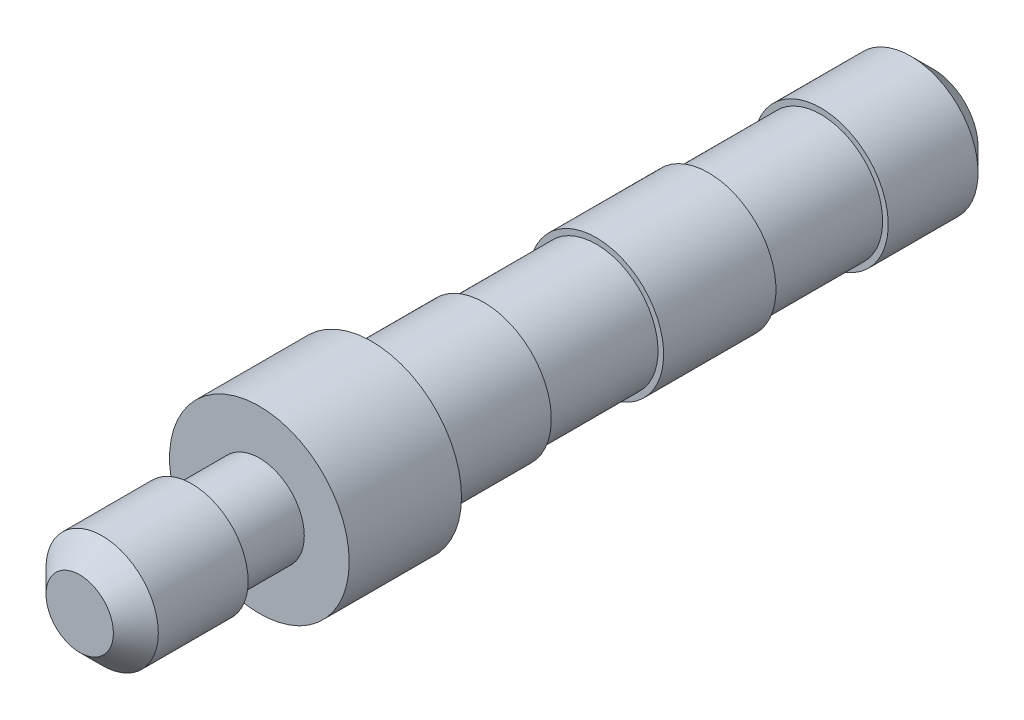
ISO-10303-21;
HEADER;
FILE_DESCRIPTION(('STEP AP214'),'2;1');
FILE_NAME('part.step','',(''),(''),'','','');
FILE_SCHEMA(('AUTOMOTIVE_DESIGN { 1 0 10303 214 1 1 1 1 }'));
ENDSEC;
DATA;
#1=APPLICATION_CONTEXT('core data for automotive mechanical design processes');
#2=APPLICATION_PROTOCOL_DEFINITION('international standard','automotive_design',2000,#1);
#3=PRODUCT_CONTEXT('',#1,'mechanical');
#4=PRODUCT('Part','Part','',(#3));
#5=PRODUCT_RELATED_PRODUCT_CATEGORY('part','',(#4));
#6=PRODUCT_DEFINITION_FORMATION('','',#4);
#7=PRODUCT_DEFINITION_CONTEXT('part definition',#1,'design');
#8=PRODUCT_DEFINITION('design','',#6,#7);
#9=PRODUCT_DEFINITION_SHAPE('','',#8);
#10=(LENGTH_UNIT() NAMED_UNIT(*) SI_UNIT(.MILLI.,.METRE.));
#11=(NAMED_UNIT(*) PLANE_ANGLE_UNIT() SI_UNIT($,.RADIAN.));
#12=(NAMED_UNIT(*) SI_UNIT($,.STERADIAN.) SOLID_ANGLE_UNIT());
#13=UNCERTAINTY_MEASURE_WITH_UNIT(LENGTH_MEASURE(1.E-05),#10,'distance_accuracy_value','');
#14=(GEOMETRIC_REPRESENTATION_CONTEXT(3) GLOBAL_UNCERTAINTY_ASSIGNED_CONTEXT((#13)) GLOBAL_UNIT_ASSIGNED_CONTEXT((#10,
#11,#12)) REPRESENTATION_CONTEXT('',''));
#15=CARTESIAN_POINT('',(0.,0.,0.));
#16=DIRECTION('',(0.,0.,1.));
#17=DIRECTION('',(1.,0.,0.));
#18=AXIS2_PLACEMENT_3D('',#15,#16,#17);
#19=CARTESIAN_POINT('',(0.,0.,5.));
#20=DIRECTION('',(0.,0.,-1.));
#21=DIRECTION('',(-1.,0.,0.));
#22=AXIS2_PLACEMENT_3D('',#19,#20,#21);
#23=CYLINDRICAL_SURFACE('',#22,4.);
#24=CARTESIAN_POINT('',(0.,0.,5.));
#25=DIRECTION('',(0.,0.,1.));
#26=DIRECTION('',(1.,0.,0.));
#27=AXIS2_PLACEMENT_3D('',#24,#25,#26);
#28=CIRCLE('',#27,4.);
#29=CARTESIAN_POINT('',(4.,0.,5.));
#30=VERTEX_POINT('',#29);
#31=EDGE_CURVE('E65',#30,#30,#28,.T.);
#32=ORIENTED_EDGE('',*,*,#31,.F.);
#33=EDGE_LOOP('',(#32));
#34=FACE_BOUND('',#33,.T.);
#35=CARTESIAN_POINT('',(0.,0.,0.));
#36=DIRECTION('',(0.,0.,1.));
#37=DIRECTION('',(1.,0.,0.));
#38=AXIS2_PLACEMENT_3D('',#35,#36,#37);
#39=CIRCLE('',#38,4.);
#40=CARTESIAN_POINT('',(4.,0.,0.));
#41=VERTEX_POINT('',#40);
#42=EDGE_CURVE('E62',#41,#41,#39,.T.);
#43=ORIENTED_EDGE('',*,*,#42,.T.);
#44=EDGE_LOOP('',(#43));
#45=FACE_BOUND('',#44,.T.);
#46=ADVANCED_FACE('F37',(#34,#45),#23,.T.);
#47=CARTESIAN_POINT('',(0.,0.,5.));
#48=DIRECTION('',(0.,0.,1.));
#49=DIRECTION('',(1.,0.,0.));
#50=AXIS2_PLACEMENT_3D('',#47,#48,#49);
#51=PLANE('',#50);
#52=CARTESIAN_POINT('',(0.,0.,5.));
#53=DIRECTION('',(0.,0.,1.));
#54=DIRECTION('',(1.,0.,0.));
#55=AXIS2_PLACEMENT_3D('',#52,#53,#54);
#56=CIRCLE('',#55,2.);
#57=CARTESIAN_POINT('',(2.,0.,5.));
#58=VERTEX_POINT('',#57);
#59=EDGE_CURVE('E49',#58,#58,#56,.T.);
#60=ORIENTED_EDGE('',*,*,#59,.F.);
#61=EDGE_LOOP('',(#60));
#62=FACE_BOUND('',#61,.T.);
#63=ORIENTED_EDGE('',*,*,#31,.T.);
#64=EDGE_LOOP('',(#63));
#65=FACE_BOUND('',#64,.T.);
#66=ADVANCED_FACE('F116',(#62,#65),#51,.T.);
#67=CARTESIAN_POINT('',(0.,0.,0.));
#68=DIRECTION('',(0.,0.,1.));
#69=DIRECTION('',(1.,0.,0.));
#70=AXIS2_PLACEMENT_3D('',#67,#68,#69);
#71=PLANE('',#70);
#72=CARTESIAN_POINT('',(0.,0.,0.));
#73=DIRECTION('',(0.,0.,-1.));
#74=DIRECTION('',(-1.,0.,0.));
#75=AXIS2_PLACEMENT_3D('',#72,#73,#74);
#76=CIRCLE('',#75,3.);
#77=CARTESIAN_POINT('',(-3.,0.,0.));
#78=VERTEX_POINT('',#77);
#79=EDGE_CURVE('E69',#78,#78,#76,.T.);
#80=ORIENTED_EDGE('',*,*,#79,.F.);
#81=EDGE_LOOP('',(#80));
#82=FACE_BOUND('',#81,.T.);
#83=ORIENTED_EDGE('',*,*,#42,.F.);
#84=EDGE_LOOP('',(#83));
#85=FACE_BOUND('',#84,.T.);
#86=ADVANCED_FACE('F122',(#82,#85),#71,.F.);
#87=CARTESIAN_POINT('',(0.,0.,-5.));
#88=DIRECTION('',(0.,0.,1.));
#89=DIRECTION('',(1.,0.,0.));
#90=AXIS2_PLACEMENT_3D('',#87,#88,#89);
#91=CYLINDRICAL_SURFACE('',#90,3.);
#92=CARTESIAN_POINT('',(0.,0.,-5.));
#93=DIRECTION('',(0.,0.,-1.));
#94=DIRECTION('',(-1.,0.,0.));
#95=AXIS2_PLACEMENT_3D('',#92,#93,#94);
#96=CIRCLE('',#95,3.);
#97=CARTESIAN_POINT('',(-3.,0.,-5.));
#98=VERTEX_POINT('',#97);
#99=EDGE_CURVE('E66',#98,#98,#96,.T.);
#100=ORIENTED_EDGE('',*,*,#99,.F.);
#101=EDGE_LOOP('',(#100));
#102=FACE_BOUND('',#101,.T.);
#103=ORIENTED_EDGE('',*,*,#79,.T.);
#104=EDGE_LOOP('',(#103));
#105=FACE_BOUND('',#104,.T.);
#106=ADVANCED_FACE('F181',(#102,#105),#91,.T.);
#107=CARTESIAN_POINT('',(0.,0.,-5.));
#108=DIRECTION('',(0.,0.,-1.));
#109=DIRECTION('',(-1.,0.,0.));
#110=AXIS2_PLACEMENT_3D('',#107,#108,#109);
#111=PLANE('',#110);
#112=CARTESIAN_POINT('',(0.,0.,-5.));
#113=DIRECTION('',(0.,0.,-1.));
#114=DIRECTION('',(-1.,0.,0.));
#115=AXIS2_PLACEMENT_3D('',#112,#113,#114);
#116=CIRCLE('',#115,2.75);
#117=CARTESIAN_POINT('',(-2.75,0.,-5.));
#118=VERTEX_POINT('',#117);
#119=EDGE_CURVE('E72',#118,#118,#116,.T.);
#120=ORIENTED_EDGE('',*,*,#119,.F.);
#121=EDGE_LOOP('',(#120));
#122=FACE_BOUND('',#121,.T.);
#123=ORIENTED_EDGE('',*,*,#99,.T.);
#124=EDGE_LOOP('',(#123));
#125=FACE_BOUND('',#124,.T.);
#126=ADVANCED_FACE('F177',(#122,#125),#111,.T.);
#127=CARTESIAN_POINT('',(0.,0.,-10.));
#128=DIRECTION('',(0.,0.,1.));
#129=DIRECTION('',(1.,0.,0.));
#130=AXIS2_PLACEMENT_3D('',#127,#128,#129);
#131=CYLINDRICAL_SURFACE('',#130,2.75);
#132=CARTESIAN_POINT('',(0.,0.,-10.));
#133=DIRECTION('',(0.,0.,-1.));
#134=DIRECTION('',(-1.,0.,0.));
#135=AXIS2_PLACEMENT_3D('',#132,#133,#134);
#136=CIRCLE('',#135,2.75);
#137=CARTESIAN_POINT('',(-2.75,0.,-10.));
#138=VERTEX_POINT('',#137);
#139=EDGE_CURVE('E75',#138,#138,#136,.T.);
#140=ORIENTED_EDGE('',*,*,#139,.F.);
#141=EDGE_LOOP('',(#140));
#142=FACE_BOUND('',#141,.T.);
#143=ORIENTED_EDGE('',*,*,#119,.T.);
#144=EDGE_LOOP('',(#143));
#145=FACE_BOUND('',#144,.T.);
#146=ADVANCED_FACE('F173',(#142,#145),#131,.T.);
#147=CARTESIAN_POINT('',(0.,0.,-15.));
#148=DIRECTION('',(0.,0.,1.));
#149=DIRECTION('',(1.,0.,0.));
#150=AXIS2_PLACEMENT_3D('',#147,#148,#149);
#151=CYLINDRICAL_SURFACE('',#150,3.);
#152=CARTESIAN_POINT('',(0.,0.,-15.));
#153=DIRECTION('',(0.,0.,-1.));
#154=DIRECTION('',(-1.,0.,0.));
#155=AXIS2_PLACEMENT_3D('',#152,#153,#154);
#156=CIRCLE('',#155,3.);
#157=CARTESIAN_POINT('',(-3.,0.,-15.));
#158=VERTEX_POINT('',#157);
#159=EDGE_CURVE('E80',#158,#158,#156,.T.);
#160=ORIENTED_EDGE('',*,*,#159,.F.);
#161=EDGE_LOOP('',(#160));
#162=FACE_BOUND('',#161,.T.);
#163=CARTESIAN_POINT('',(0.,0.,-10.));
#164=DIRECTION('',(0.,0.,-1.));
#165=DIRECTION('',(-1.,0.,0.));
#166=AXIS2_PLACEMENT_3D('',#163,#164,#165);
#167=CIRCLE('',#166,3.);
#168=CARTESIAN_POINT('',(-3.,0.,-10.));
#169=VERTEX_POINT('',#168);
#170=EDGE_CURVE('E81',#169,#169,#167,.T.);
#171=ORIENTED_EDGE('',*,*,#170,.T.);
#172=EDGE_LOOP('',(#171));
#173=FACE_BOUND('',#172,.T.);
#174=ADVANCED_FACE('F166',(#162,#173),#151,.T.);
#175=CARTESIAN_POINT('',(0.,0.,-15.));
#176=DIRECTION('',(0.,0.,-1.));
#177=DIRECTION('',(-1.,0.,0.));
#178=AXIS2_PLACEMENT_3D('',#175,#176,#177);
#179=PLANE('',#178);
#180=CARTESIAN_POINT('',(0.,0.,-15.));
#181=DIRECTION('',(0.,0.,-1.));
#182=DIRECTION('',(-1.,0.,0.));
#183=AXIS2_PLACEMENT_3D('',#180,#181,#182);
#184=CIRCLE('',#183,2.75);
#185=CARTESIAN_POINT('',(-2.75,0.,-15.));
#186=VERTEX_POINT('',#185);
#187=EDGE_CURVE('E61',#186,#186,#184,.T.);
#188=ORIENTED_EDGE('',*,*,#187,.F.);
#189=EDGE_LOOP('',(#188));
#190=FACE_BOUND('',#189,.T.);
#191=ORIENTED_EDGE('',*,*,#159,.T.);
#192=EDGE_LOOP('',(#191));
#193=FACE_BOUND('',#192,.T.);
#194=ADVANCED_FACE('F163',(#190,#193),#179,.T.);
#195=CARTESIAN_POINT('',(0.,0.,-10.));
#196=DIRECTION('',(0.,0.,-1.));
#197=DIRECTION('',(-1.,0.,0.));
#198=AXIS2_PLACEMENT_3D('',#195,#196,#197);
#199=PLANE('',#198);
#200=ORIENTED_EDGE('',*,*,#139,.T.);
#201=EDGE_LOOP('',(#200));
#202=FACE_BOUND('',#201,.T.);
#203=ORIENTED_EDGE('',*,*,#170,.F.);
#204=EDGE_LOOP('',(#203));
#205=FACE_BOUND('',#204,.T.);
#206=ADVANCED_FACE('F161',(#202,#205),#199,.F.);
#207=CARTESIAN_POINT('',(0.,0.,-20.));
#208=DIRECTION('',(0.,0.,1.));
#209=DIRECTION('',(1.,0.,0.));
#210=AXIS2_PLACEMENT_3D('',#207,#208,#209);
#211=CYLINDRICAL_SURFACE('',#210,2.75);
#212=CARTESIAN_POINT('',(0.,0.,-20.));
#213=DIRECTION('',(0.,0.,-1.));
#214=DIRECTION('',(-1.,0.,0.));
#215=AXIS2_PLACEMENT_3D('',#212,#213,#214);
#216=CIRCLE('',#215,2.75);
#217=CARTESIAN_POINT('',(-2.75,0.,-20.));
#218=VERTEX_POINT('',#217);
#219=EDGE_CURVE('E84',#218,#218,#216,.T.);
#220=ORIENTED_EDGE('',*,*,#219,.F.);
#221=EDGE_LOOP('',(#220));
#222=FACE_BOUND('',#221,.T.);
#223=ORIENTED_EDGE('',*,*,#187,.T.);
#224=EDGE_LOOP('',(#223));
#225=FACE_BOUND('',#224,.T.);
#226=ADVANCED_FACE('F155',(#222,#225),#211,.T.);
#227=CARTESIAN_POINT('',(0.,0.,-25.));
#228=DIRECTION('',(0.,0.,1.));
#229=DIRECTION('',(1.,0.,0.));
#230=AXIS2_PLACEMENT_3D('',#227,#228,#229);
#231=CYLINDRICAL_SURFACE('',#230,3.);
#232=CARTESIAN_POINT('',(0.,0.,-24.));
#233=DIRECTION('',(0.,0.,-1.));
#234=DIRECTION('',(-1.,0.,0.));
#235=AXIS2_PLACEMENT_3D('',#232,#233,#234);
#236=CIRCLE('',#235,3.);
#237=CARTESIAN_POINT('',(-3.,0.,-24.));
#238=VERTEX_POINT('',#237);
#239=EDGE_CURVE('E53',#238,#238,#236,.F.);
#240=ORIENTED_EDGE('',*,*,#239,.T.);
#241=EDGE_LOOP('',(#240));
#242=FACE_BOUND('',#241,.T.);
#243=CARTESIAN_POINT('',(0.,0.,-20.));
#244=DIRECTION('',(0.,0.,-1.));
#245=DIRECTION('',(-1.,0.,0.));
#246=AXIS2_PLACEMENT_3D('',#243,#244,#245);
#247=CIRCLE('',#246,3.);
#248=CARTESIAN_POINT('',(-3.,0.,-20.));
#249=VERTEX_POINT('',#248);
#250=EDGE_CURVE('E91',#249,#249,#247,.T.);
#251=ORIENTED_EDGE('',*,*,#250,.T.);
#252=EDGE_LOOP('',(#251));
#253=FACE_BOUND('',#252,.T.);
#254=ADVANCED_FACE('F150',(#242,#253),#231,.T.);
#255=CARTESIAN_POINT('',(0.,0.,-25.));
#256=DIRECTION('',(0.,0.,-1.));
#257=DIRECTION('',(-1.,0.,0.));
#258=AXIS2_PLACEMENT_3D('',#255,#256,#257);
#259=PLANE('',#258);
#260=CARTESIAN_POINT('',(0.,0.,-25.));
#261=DIRECTION('',(0.,0.,-1.));
#262=DIRECTION('',(-1.,0.,0.));
#263=AXIS2_PLACEMENT_3D('',#260,#261,#262);
#264=CIRCLE('',#263,1.99999999999999);
#265=CARTESIAN_POINT('',(-1.99999999999999,0.,-25.));
#266=VERTEX_POINT('',#265);
#267=EDGE_CURVE('E58',#266,#266,#264,.T.);
#268=ORIENTED_EDGE('',*,*,#267,.T.);
#269=EDGE_LOOP('',(#268));
#270=FACE_BOUND('',#269,.T.);
#271=ADVANCED_FACE('F142',(#270),#259,.T.);
#272=CARTESIAN_POINT('',(0.,0.,-20.));
#273=DIRECTION('',(0.,0.,-1.));
#274=DIRECTION('',(-1.,0.,0.));
#275=AXIS2_PLACEMENT_3D('',#272,#273,#274);
#276=PLANE('',#275);
#277=ORIENTED_EDGE('',*,*,#219,.T.);
#278=EDGE_LOOP('',(#277));
#279=FACE_BOUND('',#278,.T.);
#280=ORIENTED_EDGE('',*,*,#250,.F.);
#281=EDGE_LOOP('',(#280));
#282=FACE_BOUND('',#281,.T.);
#283=ADVANCED_FACE('F134',(#279,#282),#276,.F.);
#284=CARTESIAN_POINT('',(0.,0.,-25.));
#285=DIRECTION('',(0.,0.,1.));
#286=DIRECTION('',(1.,0.,0.));
#287=AXIS2_PLACEMENT_3D('',#284,#285,#286);
#288=CONICAL_SURFACE('',#287,1.99999999999999,0.785398163397446);
#289=ORIENTED_EDGE('',*,*,#239,.F.);
#290=EDGE_LOOP('',(#289));
#291=FACE_BOUND('',#290,.T.);
#292=ORIENTED_EDGE('',*,*,#267,.F.);
#293=EDGE_LOOP('',(#292));
#294=FACE_BOUND('',#293,.T.);
#295=ADVANCED_FACE('F129',(#291,#294),#288,.T.);
#296=CARTESIAN_POINT('',(0.,0.,8.));
#297=DIRECTION('',(0.,0.,-1.));
#298=DIRECTION('',(-1.,0.,0.));
#299=AXIS2_PLACEMENT_3D('',#296,#297,#298);
#300=CYLINDRICAL_SURFACE('',#299,2.);
#301=CARTESIAN_POINT('',(0.,0.,8.));
#302=DIRECTION('',(0.,0.,1.));
#303=DIRECTION('',(1.,0.,0.));
#304=AXIS2_PLACEMENT_3D('',#301,#302,#303);
#305=CIRCLE('',#304,2.);
#306=CARTESIAN_POINT('',(2.,0.,8.));
#307=VERTEX_POINT('',#306);
#308=EDGE_CURVE('E93',#307,#307,#305,.T.);
#309=ORIENTED_EDGE('',*,*,#308,.F.);
#310=EDGE_LOOP('',(#309));
#311=FACE_BOUND('',#310,.T.);
#312=ORIENTED_EDGE('',*,*,#59,.T.);
#313=EDGE_LOOP('',(#312));
#314=FACE_BOUND('',#313,.T.);
#315=ADVANCED_FACE('F133',(#311,#314),#300,.T.);
#316=CARTESIAN_POINT('',(0.,0.,13.));
#317=DIRECTION('',(0.,0.,-1.));
#318=DIRECTION('',(-1.,0.,0.));
#319=AXIS2_PLACEMENT_3D('',#316,#317,#318);
#320=CYLINDRICAL_SURFACE('',#319,2.5);
#321=CARTESIAN_POINT('',(0.,0.,12.));
#322=DIRECTION('',(0.,0.,1.));
#323=DIRECTION('',(1.,0.,0.));
#324=AXIS2_PLACEMENT_3D('',#321,#322,#323);
#325=CIRCLE('',#324,2.5);
#326=CARTESIAN_POINT('',(2.5,0.,12.));
#327=VERTEX_POINT('',#326);
#328=EDGE_CURVE('E10',#327,#327,#325,.F.);
#329=ORIENTED_EDGE('',*,*,#328,.T.);
#330=EDGE_LOOP('',(#329));
#331=FACE_BOUND('',#330,.T.);
#332=CARTESIAN_POINT('',(0.,0.,8.));
#333=DIRECTION('',(0.,0.,1.));
#334=DIRECTION('',(1.,0.,0.));
#335=AXIS2_PLACEMENT_3D('',#332,#333,#334);
#336=CIRCLE('',#335,2.5);
#337=CARTESIAN_POINT('',(2.5,0.,8.));
#338=VERTEX_POINT('',#337);
#339=EDGE_CURVE('E97',#338,#338,#336,.T.);
#340=ORIENTED_EDGE('',*,*,#339,.T.);
#341=EDGE_LOOP('',(#340));
#342=FACE_BOUND('',#341,.T.);
#343=ADVANCED_FACE('F101',(#331,#342),#320,.T.);
#344=CARTESIAN_POINT('',(0.,0.,13.));
#345=DIRECTION('',(0.,0.,1.));
#346=DIRECTION('',(1.,0.,0.));
#347=AXIS2_PLACEMENT_3D('',#344,#345,#346);
#348=PLANE('',#347);
#349=CARTESIAN_POINT('',(0.,0.,13.));
#350=DIRECTION('',(0.,0.,1.));
#351=DIRECTION('',(1.,0.,0.));
#352=AXIS2_PLACEMENT_3D('',#349,#350,#351);
#353=CIRCLE('',#352,1.5);
#354=CARTESIAN_POINT('',(1.5,0.,13.));
#355=VERTEX_POINT('',#354);
#356=EDGE_CURVE('E45',#355,#355,#353,.T.);
#357=ORIENTED_EDGE('',*,*,#356,.T.);
#358=EDGE_LOOP('',(#357));
#359=FACE_BOUND('',#358,.T.);
#360=ADVANCED_FACE('F105',(#359),#348,.T.);
#361=CARTESIAN_POINT('',(0.,0.,8.));
#362=DIRECTION('',(0.,0.,1.));
#363=DIRECTION('',(1.,0.,0.));
#364=AXIS2_PLACEMENT_3D('',#361,#362,#363);
#365=PLANE('',#364);
#366=ORIENTED_EDGE('',*,*,#308,.T.);
#367=EDGE_LOOP('',(#366));
#368=FACE_BOUND('',#367,.T.);
#369=ORIENTED_EDGE('',*,*,#339,.F.);
#370=EDGE_LOOP('',(#369));
#371=FACE_BOUND('',#370,.T.);
#372=ADVANCED_FACE('F103',(#368,#371),#365,.F.);
#373=CARTESIAN_POINT('',(0.,0.,13.));
#374=DIRECTION('',(0.,0.,-1.));
#375=DIRECTION('',(-1.,0.,0.));
#376=AXIS2_PLACEMENT_3D('',#373,#374,#375);
#377=CONICAL_SURFACE('',#376,1.5,0.785398163397447);
#378=ORIENTED_EDGE('',*,*,#328,.F.);
#379=EDGE_LOOP('',(#378));
#380=FACE_BOUND('',#379,.T.);
#381=ORIENTED_EDGE('',*,*,#356,.F.);
#382=EDGE_LOOP('',(#381));
#383=FACE_BOUND('',#382,.T.);
#384=ADVANCED_FACE('F40',(#380,#383),#377,.T.);
#385=CLOSED_SHELL('',(#46,#66,#86,#106,#126,#146,#174,#194,#206,#226,#254,#271,#283,#295,#315,
#343,#360,#372,#384));
#386=MANIFOLD_SOLID_BREP('B2',#385);
#387=ADVANCED_BREP_SHAPE_REPRESENTATION('',(#18,#386),#14);
#388=SHAPE_DEFINITION_REPRESENTATION(#9,#387);
ENDSEC;
END-ISO-10303-21;
